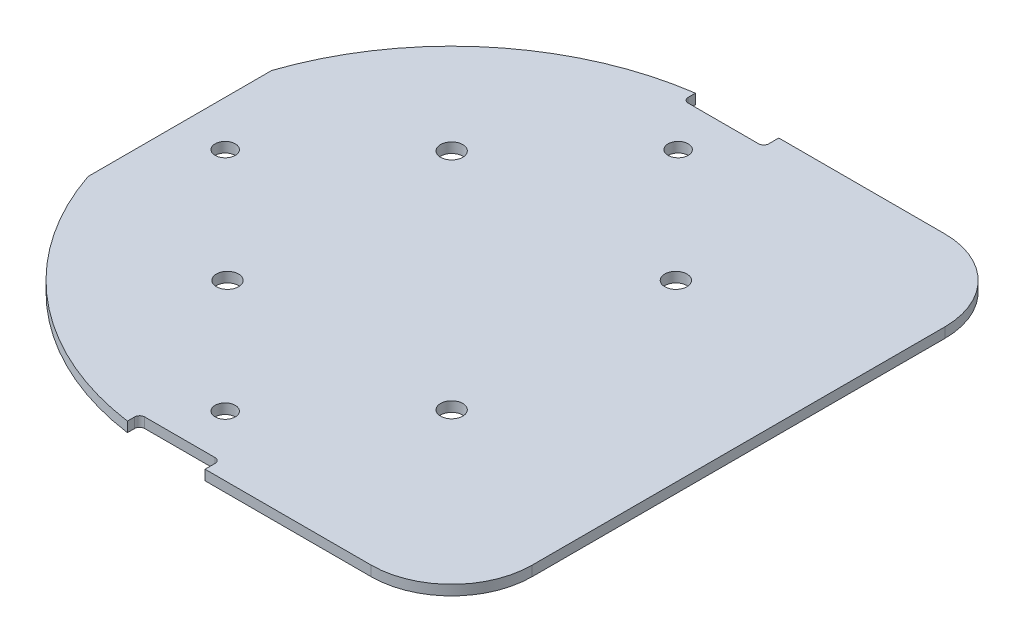
ISO-10303-21;
HEADER;
FILE_DESCRIPTION(('STEP AP214'),'2;1');
FILE_NAME('part.step','',(''),(''),'','','');
FILE_SCHEMA(('AUTOMOTIVE_DESIGN { 1 0 10303 214 1 1 1 1 }'));
ENDSEC;
DATA;
#1=APPLICATION_CONTEXT('core data for automotive mechanical design processes');
#2=APPLICATION_PROTOCOL_DEFINITION('international standard','automotive_design',2000,#1);
#3=PRODUCT_CONTEXT('',#1,'mechanical');
#4=PRODUCT('Part','Part','',(#3));
#5=PRODUCT_RELATED_PRODUCT_CATEGORY('part','',(#4));
#6=PRODUCT_DEFINITION_FORMATION('','',#4);
#7=PRODUCT_DEFINITION_CONTEXT('part definition',#1,'design');
#8=PRODUCT_DEFINITION('design','',#6,#7);
#9=PRODUCT_DEFINITION_SHAPE('','',#8);
#10=(LENGTH_UNIT() NAMED_UNIT(*) SI_UNIT(.MILLI.,.METRE.));
#11=(NAMED_UNIT(*) PLANE_ANGLE_UNIT() SI_UNIT($,.RADIAN.));
#12=(NAMED_UNIT(*) SI_UNIT($,.STERADIAN.) SOLID_ANGLE_UNIT());
#13=UNCERTAINTY_MEASURE_WITH_UNIT(LENGTH_MEASURE(1.E-05),#10,'distance_accuracy_value','');
#14=(GEOMETRIC_REPRESENTATION_CONTEXT(3) GLOBAL_UNCERTAINTY_ASSIGNED_CONTEXT((#13)) GLOBAL_UNIT_ASSIGNED_CONTEXT((#10,
#11,#12)) REPRESENTATION_CONTEXT('',''));
#15=CARTESIAN_POINT('',(0.,0.,0.));
#16=DIRECTION('',(0.,0.,1.));
#17=DIRECTION('',(1.,0.,0.));
#18=AXIS2_PLACEMENT_3D('',#15,#16,#17);
#19=CARTESIAN_POINT('',(0.,1.,28.5));
#20=DIRECTION('',(0.,0.,-1.));
#21=DIRECTION('',(-1.,0.,0.));
#22=AXIS2_PLACEMENT_3D('',#19,#20,#21);
#23=PLANE('',#22);
#24=DIRECTION('',(1.,0.,0.));
#25=VECTOR('',#24,1.);
#26=CARTESIAN_POINT('',(0.,0.,28.5));
#27=LINE('',#26,#25);
#28=CARTESIAN_POINT('',(20.5,0.,28.5));
#29=VERTEX_POINT('',#28);
#30=CARTESIAN_POINT('',(4.,0.,28.5));
#31=VERTEX_POINT('',#30);
#32=EDGE_CURVE('E281',#29,#31,#27,.F.);
#33=ORIENTED_EDGE('',*,*,#32,.F.);
#34=DIRECTION('',(0.,-1.,0.));
#35=VECTOR('',#34,1.);
#36=CARTESIAN_POINT('',(20.5,0.5,28.5));
#37=LINE('',#36,#35);
#38=CARTESIAN_POINT('',(20.5,1.,28.5));
#39=VERTEX_POINT('',#38);
#40=EDGE_CURVE('E133',#39,#29,#37,.T.);
#41=ORIENTED_EDGE('',*,*,#40,.F.);
#42=DIRECTION('',(1.,0.,0.));
#43=VECTOR('',#42,1.);
#44=CARTESIAN_POINT('',(0.,1.,28.5));
#45=LINE('',#44,#43);
#46=CARTESIAN_POINT('',(4.,1.,28.5));
#47=VERTEX_POINT('',#46);
#48=EDGE_CURVE('E182',#47,#39,#45,.T.);
#49=ORIENTED_EDGE('',*,*,#48,.F.);
#50=DIRECTION('',(0.,1.,0.));
#51=VECTOR('',#50,1.);
#52=CARTESIAN_POINT('',(4.,-0.001,28.5));
#53=LINE('',#52,#51);
#54=EDGE_CURVE('E139',#31,#47,#53,.T.);
#55=ORIENTED_EDGE('',*,*,#54,.F.);
#56=EDGE_LOOP('',(#33,#41,#49,#55));
#57=FACE_BOUND('',#56,.T.);
#58=ADVANCED_FACE('F16',(#57),#23,.F.);
#59=CARTESIAN_POINT('',(4.,-0.001,27.));
#60=DIRECTION('',(1.,0.,0.));
#61=DIRECTION('',(0.,0.,-1.));
#62=AXIS2_PLACEMENT_3D('',#59,#60,#61);
#63=PLANE('',#62);
#64=DIRECTION('',(0.,0.,1.));
#65=VECTOR('',#64,1.);
#66=CARTESIAN_POINT('',(4.,0.,0.));
#67=LINE('',#66,#65);
#68=CARTESIAN_POINT('',(4.,0.,27.5));
#69=VERTEX_POINT('',#68);
#70=EDGE_CURVE('E277',#31,#69,#67,.F.);
#71=ORIENTED_EDGE('',*,*,#70,.F.);
#72=ORIENTED_EDGE('',*,*,#54,.T.);
#73=DIRECTION('',(0.,0.,1.));
#74=VECTOR('',#73,1.);
#75=CARTESIAN_POINT('',(4.,1.,0.));
#76=LINE('',#75,#74);
#77=CARTESIAN_POINT('',(4.,1.,27.5));
#78=VERTEX_POINT('',#77);
#79=EDGE_CURVE('E185',#78,#47,#76,.T.);
#80=ORIENTED_EDGE('',*,*,#79,.F.);
#81=DIRECTION('',(0.,1.,0.));
#82=VECTOR('',#81,1.);
#83=CARTESIAN_POINT('',(4.,0.5,27.5));
#84=LINE('',#83,#82);
#85=EDGE_CURVE('E220',#69,#78,#84,.T.);
#86=ORIENTED_EDGE('',*,*,#85,.F.);
#87=EDGE_LOOP('',(#71,#72,#80,#86));
#88=FACE_BOUND('',#87,.T.);
#89=ADVANCED_FACE('F616',(#88),#63,.F.);
#90=CARTESIAN_POINT('',(3.5,1.,27.5));
#91=DIRECTION('',(0.,-1.,0.));
#92=DIRECTION('',(0.,0.,-1.));
#93=AXIS2_PLACEMENT_3D('',#90,#91,#92);
#94=CYLINDRICAL_SURFACE('',#93,0.5);
#95=CARTESIAN_POINT('',(3.5,1.,27.5));
#96=DIRECTION('',(0.,-1.,0.));
#97=DIRECTION('',(0.,0.,-1.));
#98=AXIS2_PLACEMENT_3D('',#95,#96,#97);
#99=CIRCLE('',#98,0.5);
#100=CARTESIAN_POINT('',(3.5,1.,27.));
#101=VERTEX_POINT('',#100);
#102=EDGE_CURVE('E297',#101,#78,#99,.T.);
#103=ORIENTED_EDGE('',*,*,#102,.F.);
#104=DIRECTION('',(0.,1.,0.));
#105=VECTOR('',#104,1.);
#106=CARTESIAN_POINT('',(3.5,-0.001,27.));
#107=LINE('',#106,#105);
#108=CARTESIAN_POINT('',(3.5,0.,27.));
#109=VERTEX_POINT('',#108);
#110=EDGE_CURVE('E218',#109,#101,#107,.T.);
#111=ORIENTED_EDGE('',*,*,#110,.F.);
#112=CARTESIAN_POINT('',(3.5,0.,27.5));
#113=DIRECTION('',(0.,-1.,0.));
#114=DIRECTION('',(0.,0.,-1.));
#115=AXIS2_PLACEMENT_3D('',#112,#113,#114);
#116=CIRCLE('',#115,0.5);
#117=EDGE_CURVE('E274',#69,#109,#116,.F.);
#118=ORIENTED_EDGE('',*,*,#117,.F.);
#119=ORIENTED_EDGE('',*,*,#85,.T.);
#120=EDGE_LOOP('',(#103,#111,#118,#119));
#121=FACE_BOUND('',#120,.T.);
#122=ADVANCED_FACE('F607',(#121),#94,.F.);
#123=CARTESIAN_POINT('',(-4.,-0.001,27.));
#124=DIRECTION('',(0.,0.,-1.));
#125=DIRECTION('',(-1.,0.,0.));
#126=AXIS2_PLACEMENT_3D('',#123,#124,#125);
#127=PLANE('',#126);
#128=DIRECTION('',(1.,0.,0.));
#129=VECTOR('',#128,1.);
#130=CARTESIAN_POINT('',(0.,1.,27.));
#131=LINE('',#130,#129);
#132=CARTESIAN_POINT('',(-3.5,1.,27.));
#133=VERTEX_POINT('',#132);
#134=EDGE_CURVE('E300',#133,#101,#131,.T.);
#135=ORIENTED_EDGE('',*,*,#134,.F.);
#136=DIRECTION('',(0.,1.,0.));
#137=VECTOR('',#136,1.);
#138=CARTESIAN_POINT('',(-3.5,0.5,27.));
#139=LINE('',#138,#137);
#140=CARTESIAN_POINT('',(-3.5,0.,27.));
#141=VERTEX_POINT('',#140);
#142=EDGE_CURVE('E216',#141,#133,#139,.T.);
#143=ORIENTED_EDGE('',*,*,#142,.F.);
#144=DIRECTION('',(1.,0.,0.));
#145=VECTOR('',#144,1.);
#146=CARTESIAN_POINT('',(0.,0.,27.));
#147=LINE('',#146,#145);
#148=EDGE_CURVE('E273',#109,#141,#147,.F.);
#149=ORIENTED_EDGE('',*,*,#148,.F.);
#150=ORIENTED_EDGE('',*,*,#110,.T.);
#151=EDGE_LOOP('',(#135,#143,#149,#150));
#152=FACE_BOUND('',#151,.T.);
#153=ADVANCED_FACE('F598',(#152),#127,.F.);
#154=CARTESIAN_POINT('',(-3.5,1.,27.5));
#155=DIRECTION('',(0.,-1.,0.));
#156=DIRECTION('',(0.,0.,-1.));
#157=AXIS2_PLACEMENT_3D('',#154,#155,#156);
#158=CYLINDRICAL_SURFACE('',#157,0.5);
#159=CARTESIAN_POINT('',(-3.5,1.,27.5));
#160=DIRECTION('',(0.,-1.,0.));
#161=DIRECTION('',(0.,0.,-1.));
#162=AXIS2_PLACEMENT_3D('',#159,#160,#161);
#163=CIRCLE('',#162,0.5);
#164=CARTESIAN_POINT('',(-4.,1.,27.5));
#165=VERTEX_POINT('',#164);
#166=EDGE_CURVE('E301',#165,#133,#163,.T.);
#167=ORIENTED_EDGE('',*,*,#166,.F.);
#168=DIRECTION('',(0.,1.,0.));
#169=VECTOR('',#168,1.);
#170=CARTESIAN_POINT('',(-4.,-0.001,27.5));
#171=LINE('',#170,#169);
#172=CARTESIAN_POINT('',(-4.,0.,27.5));
#173=VERTEX_POINT('',#172);
#174=EDGE_CURVE('E214',#173,#165,#171,.T.);
#175=ORIENTED_EDGE('',*,*,#174,.F.);
#176=CARTESIAN_POINT('',(-3.5,0.,27.5));
#177=DIRECTION('',(0.,-1.,0.));
#178=DIRECTION('',(0.,0.,-1.));
#179=AXIS2_PLACEMENT_3D('',#176,#177,#178);
#180=CIRCLE('',#179,0.5);
#181=EDGE_CURVE('E270',#141,#173,#180,.F.);
#182=ORIENTED_EDGE('',*,*,#181,.F.);
#183=ORIENTED_EDGE('',*,*,#142,.T.);
#184=EDGE_LOOP('',(#167,#175,#182,#183));
#185=FACE_BOUND('',#184,.T.);
#186=ADVANCED_FACE('F589',(#185),#158,.F.);
#187=CARTESIAN_POINT('',(-4.,-0.001,27.));
#188=DIRECTION('',(-1.,0.,0.));
#189=DIRECTION('',(0.,0.,1.));
#190=AXIS2_PLACEMENT_3D('',#187,#188,#189);
#191=PLANE('',#190);
#192=DIRECTION('',(0.,0.,1.));
#193=VECTOR('',#192,1.);
#194=CARTESIAN_POINT('',(-4.,1.,0.));
#195=LINE('',#194,#193);
#196=CARTESIAN_POINT('',(-4.00000000000312,1.,28.2179021190445));
#197=VERTEX_POINT('',#196);
#198=EDGE_CURVE('E304',#197,#165,#195,.F.);
#199=ORIENTED_EDGE('',*,*,#198,.F.);
#200=DIRECTION('',(0.,1.,0.));
#201=VECTOR('',#200,1.);
#202=CARTESIAN_POINT('',(-4.00000000000623,0.5,28.217902119044));
#203=LINE('',#202,#201);
#204=CARTESIAN_POINT('',(-4.00000000000312,0.,28.2179021190445));
#205=VERTEX_POINT('',#204);
#206=EDGE_CURVE('E212',#205,#197,#203,.T.);
#207=ORIENTED_EDGE('',*,*,#206,.F.);
#208=DIRECTION('',(0.,0.,1.));
#209=VECTOR('',#208,1.);
#210=CARTESIAN_POINT('',(-4.,0.,0.));
#211=LINE('',#210,#209);
#212=EDGE_CURVE('E269',#173,#205,#211,.T.);
#213=ORIENTED_EDGE('',*,*,#212,.F.);
#214=ORIENTED_EDGE('',*,*,#174,.T.);
#215=EDGE_LOOP('',(#199,#207,#213,#214));
#216=FACE_BOUND('',#215,.T.);
#217=ADVANCED_FACE('F580',(#216),#191,.F.);
#218=CARTESIAN_POINT('',(0.,0.,0.));
#219=DIRECTION('',(0.,-1.,0.));
#220=DIRECTION('',(0.,0.,-1.));
#221=AXIS2_PLACEMENT_3D('',#218,#219,#220);
#222=CYLINDRICAL_SURFACE('',#221,28.5);
#223=CARTESIAN_POINT('',(0.,1.,0.));
#224=DIRECTION('',(0.,-1.,0.));
#225=DIRECTION('',(0.,0.,-1.));
#226=AXIS2_PLACEMENT_3D('',#223,#224,#225);
#227=CIRCLE('',#226,28.5);
#228=CARTESIAN_POINT('',(-27.,1.,9.12414379522367));
#229=VERTEX_POINT('',#228);
#230=EDGE_CURVE('E305',#229,#197,#227,.F.);
#231=ORIENTED_EDGE('',*,*,#230,.F.);
#232=DIRECTION('',(0.,1.,0.));
#233=VECTOR('',#232,1.);
#234=CARTESIAN_POINT('',(-27.,-0.001,9.124143795));
#235=LINE('',#234,#233);
#236=CARTESIAN_POINT('',(-27.,0.,9.12414379522367));
#237=VERTEX_POINT('',#236);
#238=EDGE_CURVE('E210',#237,#229,#235,.T.);
#239=ORIENTED_EDGE('',*,*,#238,.F.);
#240=CARTESIAN_POINT('',(0.,0.,0.));
#241=DIRECTION('',(0.,-1.,0.));
#242=DIRECTION('',(0.,0.,-1.));
#243=AXIS2_PLACEMENT_3D('',#240,#241,#242);
#244=CIRCLE('',#243,28.5);
#245=EDGE_CURVE('E266',#205,#237,#244,.T.);
#246=ORIENTED_EDGE('',*,*,#245,.F.);
#247=ORIENTED_EDGE('',*,*,#206,.T.);
#248=EDGE_LOOP('',(#231,#239,#246,#247));
#249=FACE_BOUND('',#248,.T.);
#250=ADVANCED_FACE('F571',(#249),#222,.T.);
#251=CARTESIAN_POINT('',(-27.,-0.001,-21.489350573));
#252=DIRECTION('',(1.,0.,0.));
#253=DIRECTION('',(0.,0.,-1.));
#254=AXIS2_PLACEMENT_3D('',#251,#252,#253);
#255=PLANE('',#254);
#256=DIRECTION('',(0.,1.,0.));
#257=VECTOR('',#256,1.);
#258=CARTESIAN_POINT('',(-27.0000000001357,0.5,-9.12414379504583));
#259=LINE('',#258,#257);
#260=CARTESIAN_POINT('',(-27.0000000000678,0.,-9.12414379524658));
#261=VERTEX_POINT('',#260);
#262=CARTESIAN_POINT('',(-27.0000000000678,1.,-9.12414379524658));
#263=VERTEX_POINT('',#262);
#264=EDGE_CURVE('E208',#261,#263,#259,.T.);
#265=ORIENTED_EDGE('',*,*,#264,.F.);
#266=DIRECTION('',(0.,0.,1.));
#267=VECTOR('',#266,1.);
#268=CARTESIAN_POINT('',(-27.,0.,0.));
#269=LINE('',#268,#267);
#270=EDGE_CURVE('E265',#237,#261,#269,.F.);
#271=ORIENTED_EDGE('',*,*,#270,.F.);
#272=ORIENTED_EDGE('',*,*,#238,.T.);
#273=DIRECTION('',(0.,0.,1.));
#274=VECTOR('',#273,1.);
#275=CARTESIAN_POINT('',(-27.,1.,0.));
#276=LINE('',#275,#274);
#277=EDGE_CURVE('E308',#263,#229,#276,.T.);
#278=ORIENTED_EDGE('',*,*,#277,.F.);
#279=EDGE_LOOP('',(#265,#271,#272,#278));
#280=FACE_BOUND('',#279,.T.);
#281=ADVANCED_FACE('F562',(#280),#255,.F.);
#282=CARTESIAN_POINT('',(0.,0.,0.));
#283=DIRECTION('',(0.,-1.,0.));
#284=DIRECTION('',(0.,0.,-1.));
#285=AXIS2_PLACEMENT_3D('',#282,#283,#284);
#286=CYLINDRICAL_SURFACE('',#285,28.5);
#287=CARTESIAN_POINT('',(0.,0.,0.));
#288=DIRECTION('',(0.,-1.,0.));
#289=DIRECTION('',(0.,0.,-1.));
#290=AXIS2_PLACEMENT_3D('',#287,#288,#289);
#291=CIRCLE('',#290,28.5);
#292=CARTESIAN_POINT('',(-4.,0.,-28.2179021190225));
#293=VERTEX_POINT('',#292);
#294=EDGE_CURVE('E262',#261,#293,#291,.T.);
#295=ORIENTED_EDGE('',*,*,#294,.F.);
#296=ORIENTED_EDGE('',*,*,#264,.T.);
#297=CARTESIAN_POINT('',(0.,1.,0.));
#298=DIRECTION('',(0.,-1.,0.));
#299=DIRECTION('',(0.,0.,-1.));
#300=AXIS2_PLACEMENT_3D('',#297,#298,#299);
#301=CIRCLE('',#300,28.5);
#302=CARTESIAN_POINT('',(-4.,1.,-28.2179021190225));
#303=VERTEX_POINT('',#302);
#304=EDGE_CURVE('E309',#303,#263,#301,.F.);
#305=ORIENTED_EDGE('',*,*,#304,.F.);
#306=DIRECTION('',(0.,1.,0.));
#307=VECTOR('',#306,1.);
#308=CARTESIAN_POINT('',(-4.,-0.001,-28.217902119));
#309=LINE('',#308,#307);
#310=EDGE_CURVE('E206',#293,#303,#309,.T.);
#311=ORIENTED_EDGE('',*,*,#310,.F.);
#312=EDGE_LOOP('',(#295,#296,#305,#311));
#313=FACE_BOUND('',#312,.T.);
#314=ADVANCED_FACE('F553',(#313),#286,.T.);
#315=CARTESIAN_POINT('',(-4.,-0.001,-27.));
#316=DIRECTION('',(-1.,0.,0.));
#317=DIRECTION('',(0.,0.,1.));
#318=AXIS2_PLACEMENT_3D('',#315,#316,#317);
#319=PLANE('',#318);
#320=DIRECTION('',(0.,0.,1.));
#321=VECTOR('',#320,1.);
#322=CARTESIAN_POINT('',(-4.,0.,0.));
#323=LINE('',#322,#321);
#324=CARTESIAN_POINT('',(-4.,0.,-27.5));
#325=VERTEX_POINT('',#324);
#326=EDGE_CURVE('E261',#293,#325,#323,.T.);
#327=ORIENTED_EDGE('',*,*,#326,.F.);
#328=ORIENTED_EDGE('',*,*,#310,.T.);
#329=DIRECTION('',(0.,0.,1.));
#330=VECTOR('',#329,1.);
#331=CARTESIAN_POINT('',(-4.,1.,0.));
#332=LINE('',#331,#330);
#333=CARTESIAN_POINT('',(-4.,1.,-27.5));
#334=VERTEX_POINT('',#333);
#335=EDGE_CURVE('E312',#334,#303,#332,.F.);
#336=ORIENTED_EDGE('',*,*,#335,.F.);
#337=DIRECTION('',(0.,1.,0.));
#338=VECTOR('',#337,1.);
#339=CARTESIAN_POINT('',(-4.,0.5,-27.5));
#340=LINE('',#339,#338);
#341=EDGE_CURVE('E204',#325,#334,#340,.T.);
#342=ORIENTED_EDGE('',*,*,#341,.F.);
#343=EDGE_LOOP('',(#327,#328,#336,#342));
#344=FACE_BOUND('',#343,.T.);
#345=ADVANCED_FACE('F544',(#344),#319,.F.);
#346=CARTESIAN_POINT('',(-3.5,1.,-27.5));
#347=DIRECTION('',(0.,-1.,0.));
#348=DIRECTION('',(0.,0.,-1.));
#349=AXIS2_PLACEMENT_3D('',#346,#347,#348);
#350=CYLINDRICAL_SURFACE('',#349,0.5);
#351=CARTESIAN_POINT('',(-3.5,1.,-27.5));
#352=DIRECTION('',(0.,-1.,0.));
#353=DIRECTION('',(0.,0.,-1.));
#354=AXIS2_PLACEMENT_3D('',#351,#352,#353);
#355=CIRCLE('',#354,0.5);
#356=CARTESIAN_POINT('',(-3.5,1.,-27.));
#357=VERTEX_POINT('',#356);
#358=EDGE_CURVE('E313',#357,#334,#355,.T.);
#359=ORIENTED_EDGE('',*,*,#358,.F.);
#360=DIRECTION('',(0.,1.,0.));
#361=VECTOR('',#360,1.);
#362=CARTESIAN_POINT('',(-3.5,-0.001,-27.));
#363=LINE('',#362,#361);
#364=CARTESIAN_POINT('',(-3.5,0.,-27.));
#365=VERTEX_POINT('',#364);
#366=EDGE_CURVE('E202',#365,#357,#363,.T.);
#367=ORIENTED_EDGE('',*,*,#366,.F.);
#368=CARTESIAN_POINT('',(-3.5,0.,-27.5));
#369=DIRECTION('',(0.,-1.,0.));
#370=DIRECTION('',(0.,0.,-1.));
#371=AXIS2_PLACEMENT_3D('',#368,#369,#370);
#372=CIRCLE('',#371,0.5);
#373=EDGE_CURVE('E258',#325,#365,#372,.F.);
#374=ORIENTED_EDGE('',*,*,#373,.F.);
#375=ORIENTED_EDGE('',*,*,#341,.T.);
#376=EDGE_LOOP('',(#359,#367,#374,#375));
#377=FACE_BOUND('',#376,.T.);
#378=ADVANCED_FACE('F535',(#377),#350,.F.);
#379=CARTESIAN_POINT('',(-4.,-0.001,-27.));
#380=DIRECTION('',(0.,0.,1.));
#381=DIRECTION('',(1.,0.,0.));
#382=AXIS2_PLACEMENT_3D('',#379,#380,#381);
#383=PLANE('',#382);
#384=DIRECTION('',(1.,0.,0.));
#385=VECTOR('',#384,1.);
#386=CARTESIAN_POINT('',(0.,1.,-27.));
#387=LINE('',#386,#385);
#388=CARTESIAN_POINT('',(3.5,1.,-27.));
#389=VERTEX_POINT('',#388);
#390=EDGE_CURVE('E316',#389,#357,#387,.F.);
#391=ORIENTED_EDGE('',*,*,#390,.F.);
#392=DIRECTION('',(0.,1.,0.));
#393=VECTOR('',#392,1.);
#394=CARTESIAN_POINT('',(3.5,0.5,-27.));
#395=LINE('',#394,#393);
#396=CARTESIAN_POINT('',(3.5,0.,-27.));
#397=VERTEX_POINT('',#396);
#398=EDGE_CURVE('E200',#397,#389,#395,.T.);
#399=ORIENTED_EDGE('',*,*,#398,.F.);
#400=DIRECTION('',(1.,0.,0.));
#401=VECTOR('',#400,1.);
#402=CARTESIAN_POINT('',(0.,0.,-27.));
#403=LINE('',#402,#401);
#404=EDGE_CURVE('E257',#365,#397,#403,.T.);
#405=ORIENTED_EDGE('',*,*,#404,.F.);
#406=ORIENTED_EDGE('',*,*,#366,.T.);
#407=EDGE_LOOP('',(#391,#399,#405,#406));
#408=FACE_BOUND('',#407,.T.);
#409=ADVANCED_FACE('F526',(#408),#383,.F.);
#410=CARTESIAN_POINT('',(3.5,1.,-27.5));
#411=DIRECTION('',(0.,-1.,0.));
#412=DIRECTION('',(0.,0.,-1.));
#413=AXIS2_PLACEMENT_3D('',#410,#411,#412);
#414=CYLINDRICAL_SURFACE('',#413,0.5);
#415=CARTESIAN_POINT('',(3.5,1.,-27.5));
#416=DIRECTION('',(0.,-1.,0.));
#417=DIRECTION('',(0.,0.,-1.));
#418=AXIS2_PLACEMENT_3D('',#415,#416,#417);
#419=CIRCLE('',#418,0.5);
#420=CARTESIAN_POINT('',(4.,1.,-27.5));
#421=VERTEX_POINT('',#420);
#422=EDGE_CURVE('E167',#421,#389,#419,.T.);
#423=ORIENTED_EDGE('',*,*,#422,.F.);
#424=DIRECTION('',(0.,1.,0.));
#425=VECTOR('',#424,1.);
#426=CARTESIAN_POINT('',(4.,-0.001,-27.5));
#427=LINE('',#426,#425);
#428=CARTESIAN_POINT('',(4.,0.,-27.5));
#429=VERTEX_POINT('',#428);
#430=EDGE_CURVE('E159',#429,#421,#427,.T.);
#431=ORIENTED_EDGE('',*,*,#430,.F.);
#432=CARTESIAN_POINT('',(3.5,0.,-27.5));
#433=DIRECTION('',(0.,-1.,0.));
#434=DIRECTION('',(0.,0.,-1.));
#435=AXIS2_PLACEMENT_3D('',#432,#433,#434);
#436=CIRCLE('',#435,0.5);
#437=EDGE_CURVE('E253',#397,#429,#436,.F.);
#438=ORIENTED_EDGE('',*,*,#437,.F.);
#439=ORIENTED_EDGE('',*,*,#398,.T.);
#440=EDGE_LOOP('',(#423,#431,#438,#439));
#441=FACE_BOUND('',#440,.T.);
#442=ADVANCED_FACE('F518',(#441),#414,.F.);
#443=CARTESIAN_POINT('',(4.,-0.001,-27.));
#444=DIRECTION('',(1.,0.,0.));
#445=DIRECTION('',(0.,0.,-1.));
#446=AXIS2_PLACEMENT_3D('',#443,#444,#445);
#447=PLANE('',#446);
#448=DIRECTION('',(0.,0.,1.));
#449=VECTOR('',#448,1.);
#450=CARTESIAN_POINT('',(4.,1.,0.));
#451=LINE('',#450,#449);
#452=CARTESIAN_POINT('',(4.,1.,-28.5));
#453=VERTEX_POINT('',#452);
#454=EDGE_CURVE('E162',#453,#421,#451,.T.);
#455=ORIENTED_EDGE('',*,*,#454,.F.);
#456=DIRECTION('',(0.,1.,0.));
#457=VECTOR('',#456,1.);
#458=CARTESIAN_POINT('',(4.,1.,-28.5));
#459=LINE('',#458,#457);
#460=CARTESIAN_POINT('',(4.,0.,-28.5));
#461=VERTEX_POINT('',#460);
#462=EDGE_CURVE('E147',#461,#453,#459,.T.);
#463=ORIENTED_EDGE('',*,*,#462,.F.);
#464=DIRECTION('',(0.,0.,1.));
#465=VECTOR('',#464,1.);
#466=CARTESIAN_POINT('',(4.,0.,0.));
#467=LINE('',#466,#465);
#468=EDGE_CURVE('E256',#429,#461,#467,.F.);
#469=ORIENTED_EDGE('',*,*,#468,.F.);
#470=ORIENTED_EDGE('',*,*,#430,.T.);
#471=EDGE_LOOP('',(#455,#463,#469,#470));
#472=FACE_BOUND('',#471,.T.);
#473=ADVANCED_FACE('F163',(#472),#447,.F.);
#474=CARTESIAN_POINT('',(0.,1.,-28.5));
#475=DIRECTION('',(0.,0.,1.));
#476=DIRECTION('',(1.,0.,0.));
#477=AXIS2_PLACEMENT_3D('',#474,#475,#476);
#478=PLANE('',#477);
#479=DIRECTION('',(1.,0.,0.));
#480=VECTOR('',#479,1.);
#481=CARTESIAN_POINT('',(0.,1.,-28.5));
#482=LINE('',#481,#480);
#483=CARTESIAN_POINT('',(20.5,1.,-28.5));
#484=VERTEX_POINT('',#483);
#485=EDGE_CURVE('E151',#484,#453,#482,.F.);
#486=ORIENTED_EDGE('',*,*,#485,.F.);
#487=DIRECTION('',(0.,1.,0.));
#488=VECTOR('',#487,1.);
#489=CARTESIAN_POINT('',(20.5,0.5,-28.5));
#490=LINE('',#489,#488);
#491=CARTESIAN_POINT('',(20.5,0.,-28.5));
#492=VERTEX_POINT('',#491);
#493=EDGE_CURVE('E158',#492,#484,#490,.T.);
#494=ORIENTED_EDGE('',*,*,#493,.F.);
#495=DIRECTION('',(1.,0.,0.));
#496=VECTOR('',#495,1.);
#497=CARTESIAN_POINT('',(0.,0.,-28.5));
#498=LINE('',#497,#496);
#499=EDGE_CURVE('E154',#461,#492,#498,.T.);
#500=ORIENTED_EDGE('',*,*,#499,.F.);
#501=ORIENTED_EDGE('',*,*,#462,.T.);
#502=EDGE_LOOP('',(#486,#494,#500,#501));
#503=FACE_BOUND('',#502,.T.);
#504=ADVANCED_FACE('F149',(#503),#478,.F.);
#505=CARTESIAN_POINT('',(20.5,0.,-20.5));
#506=DIRECTION('',(0.,-1.,0.));
#507=DIRECTION('',(0.,0.,-1.));
#508=AXIS2_PLACEMENT_3D('',#505,#506,#507);
#509=CYLINDRICAL_SURFACE('',#508,8.);
#510=CARTESIAN_POINT('',(20.5,1.,-20.5));
#511=DIRECTION('',(0.,-1.,0.));
#512=DIRECTION('',(0.,0.,-1.));
#513=AXIS2_PLACEMENT_3D('',#510,#511,#512);
#514=CIRCLE('',#513,8.);
#515=CARTESIAN_POINT('',(28.5,1.,-20.5));
#516=VERTEX_POINT('',#515);
#517=EDGE_CURVE('E173',#516,#484,#514,.F.);
#518=ORIENTED_EDGE('',*,*,#517,.F.);
#519=DIRECTION('',(0.,1.,0.));
#520=VECTOR('',#519,1.);
#521=CARTESIAN_POINT('',(28.5,1.,-20.5));
#522=LINE('',#521,#520);
#523=CARTESIAN_POINT('',(28.5,0.,-20.5));
#524=VERTEX_POINT('',#523);
#525=EDGE_CURVE('E194',#524,#516,#522,.T.);
#526=ORIENTED_EDGE('',*,*,#525,.F.);
#527=CARTESIAN_POINT('',(20.5,0.,-20.5));
#528=DIRECTION('',(0.,-1.,0.));
#529=DIRECTION('',(0.,0.,-1.));
#530=AXIS2_PLACEMENT_3D('',#527,#528,#529);
#531=CIRCLE('',#530,8.);
#532=EDGE_CURVE('E250',#492,#524,#531,.T.);
#533=ORIENTED_EDGE('',*,*,#532,.F.);
#534=ORIENTED_EDGE('',*,*,#493,.T.);
#535=EDGE_LOOP('',(#518,#526,#533,#534));
#536=FACE_BOUND('',#535,.T.);
#537=ADVANCED_FACE('F359',(#536),#509,.T.);
#538=CARTESIAN_POINT('',(28.5,1.,-20.5));
#539=DIRECTION('',(-1.,0.,0.));
#540=DIRECTION('',(0.,0.,1.));
#541=AXIS2_PLACEMENT_3D('',#538,#539,#540);
#542=PLANE('',#541);
#543=DIRECTION('',(0.,0.,1.));
#544=VECTOR('',#543,1.);
#545=CARTESIAN_POINT('',(28.5,1.,0.));
#546=LINE('',#545,#544);
#547=CARTESIAN_POINT('',(28.5,1.,20.5));
#548=VERTEX_POINT('',#547);
#549=EDGE_CURVE('E175',#548,#516,#546,.F.);
#550=ORIENTED_EDGE('',*,*,#549,.F.);
#551=DIRECTION('',(0.,1.,0.));
#552=VECTOR('',#551,1.);
#553=CARTESIAN_POINT('',(28.5,0.5,20.5));
#554=LINE('',#553,#552);
#555=CARTESIAN_POINT('',(28.5,0.,20.5));
#556=VERTEX_POINT('',#555);
#557=EDGE_CURVE('E34',#556,#548,#554,.T.);
#558=ORIENTED_EDGE('',*,*,#557,.F.);
#559=DIRECTION('',(0.,0.,1.));
#560=VECTOR('',#559,1.);
#561=CARTESIAN_POINT('',(28.5,0.,0.));
#562=LINE('',#561,#560);
#563=EDGE_CURVE('E249',#524,#556,#562,.T.);
#564=ORIENTED_EDGE('',*,*,#563,.F.);
#565=ORIENTED_EDGE('',*,*,#525,.T.);
#566=EDGE_LOOP('',(#550,#558,#564,#565));
#567=FACE_BOUND('',#566,.T.);
#568=ADVANCED_FACE('F356',(#567),#542,.F.);
#569=CARTESIAN_POINT('',(20.5,0.,20.5));
#570=DIRECTION('',(0.,-1.,0.));
#571=DIRECTION('',(0.,0.,-1.));
#572=AXIS2_PLACEMENT_3D('',#569,#570,#571);
#573=CYLINDRICAL_SURFACE('',#572,8.);
#574=CARTESIAN_POINT('',(20.5,1.,20.5));
#575=DIRECTION('',(0.,-1.,0.));
#576=DIRECTION('',(0.,0.,-1.));
#577=AXIS2_PLACEMENT_3D('',#574,#575,#576);
#578=CIRCLE('',#577,8.);
#579=EDGE_CURVE('E19',#39,#548,#578,.F.);
#580=ORIENTED_EDGE('',*,*,#579,.F.);
#581=ORIENTED_EDGE('',*,*,#40,.T.);
#582=CARTESIAN_POINT('',(20.5,0.,20.5));
#583=DIRECTION('',(0.,-1.,0.));
#584=DIRECTION('',(0.,0.,-1.));
#585=AXIS2_PLACEMENT_3D('',#582,#583,#584);
#586=CIRCLE('',#585,8.);
#587=EDGE_CURVE('E246',#556,#29,#586,.T.);
#588=ORIENTED_EDGE('',*,*,#587,.F.);
#589=ORIENTED_EDGE('',*,*,#557,.T.);
#590=EDGE_LOOP('',(#580,#581,#588,#589));
#591=FACE_BOUND('',#590,.T.);
#592=ADVANCED_FACE('F361',(#591),#573,.T.);
#593=CARTESIAN_POINT('',(-11.136931804,1.,-11.136931804));
#594=DIRECTION('',(0.,-1.,0.));
#595=DIRECTION('',(0.,0.,-1.));
#596=AXIS2_PLACEMENT_3D('',#593,#594,#595);
#597=CYLINDRICAL_SURFACE('',#596,1.1);
#598=CARTESIAN_POINT('',(-11.136931804,0.9999999996881,-11.136931804));
#599=DIRECTION('',(0.,-1.,0.));
#600=DIRECTION('',(0.,0.,-1.));
#601=AXIS2_PLACEMENT_3D('',#598,#599,#600);
#602=CIRCLE('',#601,1.1);
#603=CARTESIAN_POINT('',(-11.136931804,0.9999999996881,-12.236931804));
#604=VERTEX_POINT('',#603);
#605=EDGE_CURVE('E285',#604,#604,#602,.T.);
#606=ORIENTED_EDGE('',*,*,#605,.F.);
#607=EDGE_LOOP('',(#606));
#608=FACE_BOUND('',#607,.T.);
#609=CARTESIAN_POINT('',(-11.136931804,-3.11899811533678E-10,-11.136931804));
#610=DIRECTION('',(0.,-1.,0.));
#611=DIRECTION('',(0.,0.,-1.));
#612=AXIS2_PLACEMENT_3D('',#609,#610,#611);
#613=CIRCLE('',#612,1.1);
#614=CARTESIAN_POINT('',(-11.136931804,-3.11899811533678E-10,-12.236931804));
#615=VERTEX_POINT('',#614);
#616=EDGE_CURVE('E243',#615,#615,#613,.F.);
#617=ORIENTED_EDGE('',*,*,#616,.F.);
#618=EDGE_LOOP('',(#617));
#619=FACE_BOUND('',#618,.T.);
#620=ADVANCED_FACE('F363',(#608,#619),#597,.F.);
#621=CARTESIAN_POINT('',(11.136931804,1.,-11.136931804));
#622=DIRECTION('',(0.,-1.,0.));
#623=DIRECTION('',(0.,0.,-1.));
#624=AXIS2_PLACEMENT_3D('',#621,#622,#623);
#625=CYLINDRICAL_SURFACE('',#624,1.1);
#626=CARTESIAN_POINT('',(11.136931804,0.9999999996881,-11.136931804));
#627=DIRECTION('',(0.,-1.,0.));
#628=DIRECTION('',(0.,0.,-1.));
#629=AXIS2_PLACEMENT_3D('',#626,#627,#628);
#630=CIRCLE('',#629,1.1);
#631=CARTESIAN_POINT('',(11.136931804,0.9999999996881,-12.236931804));
#632=VERTEX_POINT('',#631);
#633=EDGE_CURVE('E288',#632,#632,#630,.T.);
#634=ORIENTED_EDGE('',*,*,#633,.F.);
#635=EDGE_LOOP('',(#634));
#636=FACE_BOUND('',#635,.T.);
#637=CARTESIAN_POINT('',(11.136931804,-3.11899811533678E-10,-11.136931804));
#638=DIRECTION('',(0.,-1.,0.));
#639=DIRECTION('',(0.,0.,-1.));
#640=AXIS2_PLACEMENT_3D('',#637,#638,#639);
#641=CIRCLE('',#640,1.1);
#642=CARTESIAN_POINT('',(11.136931804,-3.11899811533678E-10,-12.236931804));
#643=VERTEX_POINT('',#642);
#644=EDGE_CURVE('E240',#643,#643,#641,.F.);
#645=ORIENTED_EDGE('',*,*,#644,.F.);
#646=EDGE_LOOP('',(#645));
#647=FACE_BOUND('',#646,.T.);
#648=ADVANCED_FACE('F370',(#636,#647),#625,.F.);
#649=CARTESIAN_POINT('',(11.136931804,1.,11.136931804));
#650=DIRECTION('',(0.,-1.,0.));
#651=DIRECTION('',(0.,0.,-1.));
#652=AXIS2_PLACEMENT_3D('',#649,#650,#651);
#653=CYLINDRICAL_SURFACE('',#652,1.1);
#654=CARTESIAN_POINT('',(11.136931804,1.0000000003119,11.136931804));
#655=DIRECTION('',(0.,-1.,0.));
#656=DIRECTION('',(0.,0.,-1.));
#657=AXIS2_PLACEMENT_3D('',#654,#655,#656);
#658=CIRCLE('',#657,1.1);
#659=CARTESIAN_POINT('',(11.136931804,1.0000000003119,10.036931804));
#660=VERTEX_POINT('',#659);
#661=EDGE_CURVE('E282',#660,#660,#658,.T.);
#662=ORIENTED_EDGE('',*,*,#661,.F.);
#663=EDGE_LOOP('',(#662));
#664=FACE_BOUND('',#663,.T.);
#665=CARTESIAN_POINT('',(11.136931804,3.11899811533678E-10,11.136931804));
#666=DIRECTION('',(0.,-1.,0.));
#667=DIRECTION('',(0.,0.,-1.));
#668=AXIS2_PLACEMENT_3D('',#665,#666,#667);
#669=CIRCLE('',#668,1.1);
#670=CARTESIAN_POINT('',(11.136931804,3.11899811533678E-10,10.036931804));
#671=VERTEX_POINT('',#670);
#672=EDGE_CURVE('E237',#671,#671,#669,.F.);
#673=ORIENTED_EDGE('',*,*,#672,.F.);
#674=EDGE_LOOP('',(#673));
#675=FACE_BOUND('',#674,.T.);
#676=ADVANCED_FACE('F399',(#664,#675),#653,.F.);
#677=CARTESIAN_POINT('',(0.,1.,-22.5));
#678=DIRECTION('',(0.,-1.,0.));
#679=DIRECTION('',(0.,0.,-1.));
#680=AXIS2_PLACEMENT_3D('',#677,#678,#679);
#681=CYLINDRICAL_SURFACE('',#680,1.);
#682=CARTESIAN_POINT('',(0.,1.,-22.5));
#683=DIRECTION('',(0.,-1.,0.));
#684=DIRECTION('',(0.,0.,-1.));
#685=AXIS2_PLACEMENT_3D('',#682,#683,#684);
#686=CIRCLE('',#685,1.);
#687=CARTESIAN_POINT('',(0.,1.,-23.5));
#688=VERTEX_POINT('',#687);
#689=EDGE_CURVE('E291',#688,#688,#686,.T.);
#690=ORIENTED_EDGE('',*,*,#689,.F.);
#691=EDGE_LOOP('',(#690));
#692=FACE_BOUND('',#691,.T.);
#693=CARTESIAN_POINT('',(0.,0.,-22.5));
#694=DIRECTION('',(0.,-1.,0.));
#695=DIRECTION('',(0.,0.,-1.));
#696=AXIS2_PLACEMENT_3D('',#693,#694,#695);
#697=CIRCLE('',#696,1.);
#698=CARTESIAN_POINT('',(0.,0.,-23.5));
#699=VERTEX_POINT('',#698);
#700=EDGE_CURVE('E234',#699,#699,#697,.F.);
#701=ORIENTED_EDGE('',*,*,#700,.F.);
#702=EDGE_LOOP('',(#701));
#703=FACE_BOUND('',#702,.T.);
#704=ADVANCED_FACE('F395',(#692,#703),#681,.F.);
#705=CARTESIAN_POINT('',(-11.136931804,1.,11.136931804));
#706=DIRECTION('',(0.,-1.,0.));
#707=DIRECTION('',(0.,0.,-1.));
#708=AXIS2_PLACEMENT_3D('',#705,#706,#707);
#709=CYLINDRICAL_SURFACE('',#708,1.1);
#710=CARTESIAN_POINT('',(-11.136931804,1.0000000003119,11.136931804));
#711=DIRECTION('',(0.,-1.,0.));
#712=DIRECTION('',(0.,0.,-1.));
#713=AXIS2_PLACEMENT_3D('',#710,#711,#712);
#714=CIRCLE('',#713,1.1);
#715=CARTESIAN_POINT('',(-11.136931804,1.0000000003119,10.036931804));
#716=VERTEX_POINT('',#715);
#717=EDGE_CURVE('E278',#716,#716,#714,.T.);
#718=ORIENTED_EDGE('',*,*,#717,.F.);
#719=EDGE_LOOP('',(#718));
#720=FACE_BOUND('',#719,.T.);
#721=CARTESIAN_POINT('',(-11.136931804,3.11899811533678E-10,11.136931804));
#722=DIRECTION('',(0.,-1.,0.));
#723=DIRECTION('',(0.,0.,-1.));
#724=AXIS2_PLACEMENT_3D('',#721,#722,#723);
#725=CIRCLE('',#724,1.1);
#726=CARTESIAN_POINT('',(-11.136931804,3.11899811533678E-10,10.036931804));
#727=VERTEX_POINT('',#726);
#728=EDGE_CURVE('E231',#727,#727,#725,.F.);
#729=ORIENTED_EDGE('',*,*,#728,.F.);
#730=EDGE_LOOP('',(#729));
#731=FACE_BOUND('',#730,.T.);
#732=ADVANCED_FACE('F391',(#720,#731),#709,.F.);
#733=CARTESIAN_POINT('',(0.,1.,22.5));
#734=DIRECTION('',(0.,-1.,0.));
#735=DIRECTION('',(0.,0.,-1.));
#736=AXIS2_PLACEMENT_3D('',#733,#734,#735);
#737=CYLINDRICAL_SURFACE('',#736,0.999999999999997);
#738=CARTESIAN_POINT('',(0.,1.,22.5));
#739=DIRECTION('',(0.,-1.,0.));
#740=DIRECTION('',(0.,0.,-1.));
#741=AXIS2_PLACEMENT_3D('',#738,#739,#740);
#742=CIRCLE('',#741,0.999999999999997);
#743=CARTESIAN_POINT('',(0.,1.,21.5));
#744=VERTEX_POINT('',#743);
#745=EDGE_CURVE('E294',#744,#744,#742,.T.);
#746=ORIENTED_EDGE('',*,*,#745,.F.);
#747=EDGE_LOOP('',(#746));
#748=FACE_BOUND('',#747,.T.);
#749=CARTESIAN_POINT('',(0.,0.,22.5));
#750=DIRECTION('',(0.,-1.,0.));
#751=DIRECTION('',(0.,0.,-1.));
#752=AXIS2_PLACEMENT_3D('',#749,#750,#751);
#753=CIRCLE('',#752,0.999999999999997);
#754=CARTESIAN_POINT('',(0.,0.,21.5));
#755=VERTEX_POINT('',#754);
#756=EDGE_CURVE('E228',#755,#755,#753,.F.);
#757=ORIENTED_EDGE('',*,*,#756,.F.);
#758=EDGE_LOOP('',(#757));
#759=FACE_BOUND('',#758,.T.);
#760=ADVANCED_FACE('F387',(#748,#759),#737,.F.);
#761=CARTESIAN_POINT('',(0.,1.,0.));
#762=DIRECTION('',(0.,1.,0.));
#763=DIRECTION('',(0.,0.,1.));
#764=AXIS2_PLACEMENT_3D('',#761,#762,#763);
#765=PLANE('',#764);
#766=CARTESIAN_POINT('',(-22.5,1.,0.));
#767=DIRECTION('',(0.,-1.,0.));
#768=DIRECTION('',(0.,0.,-1.));
#769=AXIS2_PLACEMENT_3D('',#766,#767,#768);
#770=CIRCLE('',#769,1.);
#771=CARTESIAN_POINT('',(-22.5,1.,-1.));
#772=VERTEX_POINT('',#771);
#773=EDGE_CURVE('E25',#772,#772,#770,.F.);
#774=ORIENTED_EDGE('',*,*,#773,.F.);
#775=EDGE_LOOP('',(#774));
#776=FACE_BOUND('',#775,.T.);
#777=ORIENTED_EDGE('',*,*,#717,.T.);
#778=EDGE_LOOP('',(#777));
#779=FACE_BOUND('',#778,.T.);
#780=ORIENTED_EDGE('',*,*,#661,.T.);
#781=EDGE_LOOP('',(#780));
#782=FACE_BOUND('',#781,.T.);
#783=ORIENTED_EDGE('',*,*,#605,.T.);
#784=EDGE_LOOP('',(#783));
#785=FACE_BOUND('',#784,.T.);
#786=ORIENTED_EDGE('',*,*,#633,.T.);
#787=EDGE_LOOP('',(#786));
#788=FACE_BOUND('',#787,.T.);
#789=ORIENTED_EDGE('',*,*,#689,.T.);
#790=EDGE_LOOP('',(#789));
#791=FACE_BOUND('',#790,.T.);
#792=ORIENTED_EDGE('',*,*,#745,.T.);
#793=EDGE_LOOP('',(#792));
#794=FACE_BOUND('',#793,.T.);
#795=ORIENTED_EDGE('',*,*,#134,.T.);
#796=ORIENTED_EDGE('',*,*,#102,.T.);
#797=ORIENTED_EDGE('',*,*,#79,.T.);
#798=ORIENTED_EDGE('',*,*,#48,.T.);
#799=ORIENTED_EDGE('',*,*,#579,.T.);
#800=ORIENTED_EDGE('',*,*,#549,.T.);
#801=ORIENTED_EDGE('',*,*,#517,.T.);
#802=ORIENTED_EDGE('',*,*,#485,.T.);
#803=ORIENTED_EDGE('',*,*,#454,.T.);
#804=ORIENTED_EDGE('',*,*,#422,.T.);
#805=ORIENTED_EDGE('',*,*,#390,.T.);
#806=ORIENTED_EDGE('',*,*,#358,.T.);
#807=ORIENTED_EDGE('',*,*,#335,.T.);
#808=ORIENTED_EDGE('',*,*,#304,.T.);
#809=ORIENTED_EDGE('',*,*,#277,.T.);
#810=ORIENTED_EDGE('',*,*,#230,.T.);
#811=ORIENTED_EDGE('',*,*,#198,.T.);
#812=ORIENTED_EDGE('',*,*,#166,.T.);
#813=EDGE_LOOP('',(#795,#796,#797,#798,#799,#800,#801,#802,#803,#804,#805,#806,#807,#808,#809,
#810,#811,#812));
#814=FACE_BOUND('',#813,.T.);
#815=ADVANCED_FACE('F170',(#776,#779,#782,#785,#788,#791,#794,#814),#765,.T.);
#816=CARTESIAN_POINT('',(0.,0.,0.));
#817=DIRECTION('',(0.,1.,0.));
#818=DIRECTION('',(0.,0.,1.));
#819=AXIS2_PLACEMENT_3D('',#816,#817,#818);
#820=PLANE('',#819);
#821=CARTESIAN_POINT('',(-22.5,0.,0.));
#822=DIRECTION('',(0.,-1.,0.));
#823=DIRECTION('',(0.,0.,-1.));
#824=AXIS2_PLACEMENT_3D('',#821,#822,#823);
#825=CIRCLE('',#824,1.);
#826=CARTESIAN_POINT('',(-22.5,0.,-1.));
#827=VERTEX_POINT('',#826);
#828=EDGE_CURVE('E11',#827,#827,#825,.T.);
#829=ORIENTED_EDGE('',*,*,#828,.F.);
#830=EDGE_LOOP('',(#829));
#831=FACE_BOUND('',#830,.T.);
#832=ORIENTED_EDGE('',*,*,#756,.T.);
#833=EDGE_LOOP('',(#832));
#834=FACE_BOUND('',#833,.T.);
#835=ORIENTED_EDGE('',*,*,#728,.T.);
#836=EDGE_LOOP('',(#835));
#837=FACE_BOUND('',#836,.T.);
#838=ORIENTED_EDGE('',*,*,#700,.T.);
#839=EDGE_LOOP('',(#838));
#840=FACE_BOUND('',#839,.T.);
#841=ORIENTED_EDGE('',*,*,#672,.T.);
#842=EDGE_LOOP('',(#841));
#843=FACE_BOUND('',#842,.T.);
#844=ORIENTED_EDGE('',*,*,#644,.T.);
#845=EDGE_LOOP('',(#844));
#846=FACE_BOUND('',#845,.T.);
#847=ORIENTED_EDGE('',*,*,#616,.T.);
#848=EDGE_LOOP('',(#847));
#849=FACE_BOUND('',#848,.T.);
#850=ORIENTED_EDGE('',*,*,#563,.T.);
#851=ORIENTED_EDGE('',*,*,#587,.T.);
#852=ORIENTED_EDGE('',*,*,#32,.T.);
#853=ORIENTED_EDGE('',*,*,#70,.T.);
#854=ORIENTED_EDGE('',*,*,#117,.T.);
#855=ORIENTED_EDGE('',*,*,#148,.T.);
#856=ORIENTED_EDGE('',*,*,#181,.T.);
#857=ORIENTED_EDGE('',*,*,#212,.T.);
#858=ORIENTED_EDGE('',*,*,#245,.T.);
#859=ORIENTED_EDGE('',*,*,#270,.T.);
#860=ORIENTED_EDGE('',*,*,#294,.T.);
#861=ORIENTED_EDGE('',*,*,#326,.T.);
#862=ORIENTED_EDGE('',*,*,#373,.T.);
#863=ORIENTED_EDGE('',*,*,#404,.T.);
#864=ORIENTED_EDGE('',*,*,#437,.T.);
#865=ORIENTED_EDGE('',*,*,#468,.T.);
#866=ORIENTED_EDGE('',*,*,#499,.T.);
#867=ORIENTED_EDGE('',*,*,#532,.T.);
#868=EDGE_LOOP('',(#850,#851,#852,#853,#854,#855,#856,#857,#858,#859,#860,#861,#862,#863,#864,
#865,#866,#867));
#869=FACE_BOUND('',#868,.T.);
#870=ADVANCED_FACE('F354',(#831,#834,#837,#840,#843,#846,#849,#869),#820,.F.);
#871=CARTESIAN_POINT('',(-22.5,1.,0.));
#872=DIRECTION('',(0.,-1.,0.));
#873=DIRECTION('',(0.,0.,-1.));
#874=AXIS2_PLACEMENT_3D('',#871,#872,#873);
#875=CYLINDRICAL_SURFACE('',#874,1.);
#876=ORIENTED_EDGE('',*,*,#773,.T.);
#877=EDGE_LOOP('',(#876));
#878=FACE_BOUND('',#877,.T.);
#879=ORIENTED_EDGE('',*,*,#828,.T.);
#880=EDGE_LOOP('',(#879));
#881=FACE_BOUND('',#880,.T.);
#882=ADVANCED_FACE('F374',(#878,#881),#875,.F.);
#883=CLOSED_SHELL('',(#58,#89,#122,#153,#186,#217,#250,#281,#314,#345,#378,#409,#442,#473,#504,
#537,#568,#592,#620,#648,#676,#704,#732,#760,#815,#870,#882));
#884=MANIFOLD_SOLID_BREP('B1',#883);
#885=ADVANCED_BREP_SHAPE_REPRESENTATION('',(#18,#884),#14);
#886=SHAPE_DEFINITION_REPRESENTATION(#9,#885);
ENDSEC;
END-ISO-10303-21;
